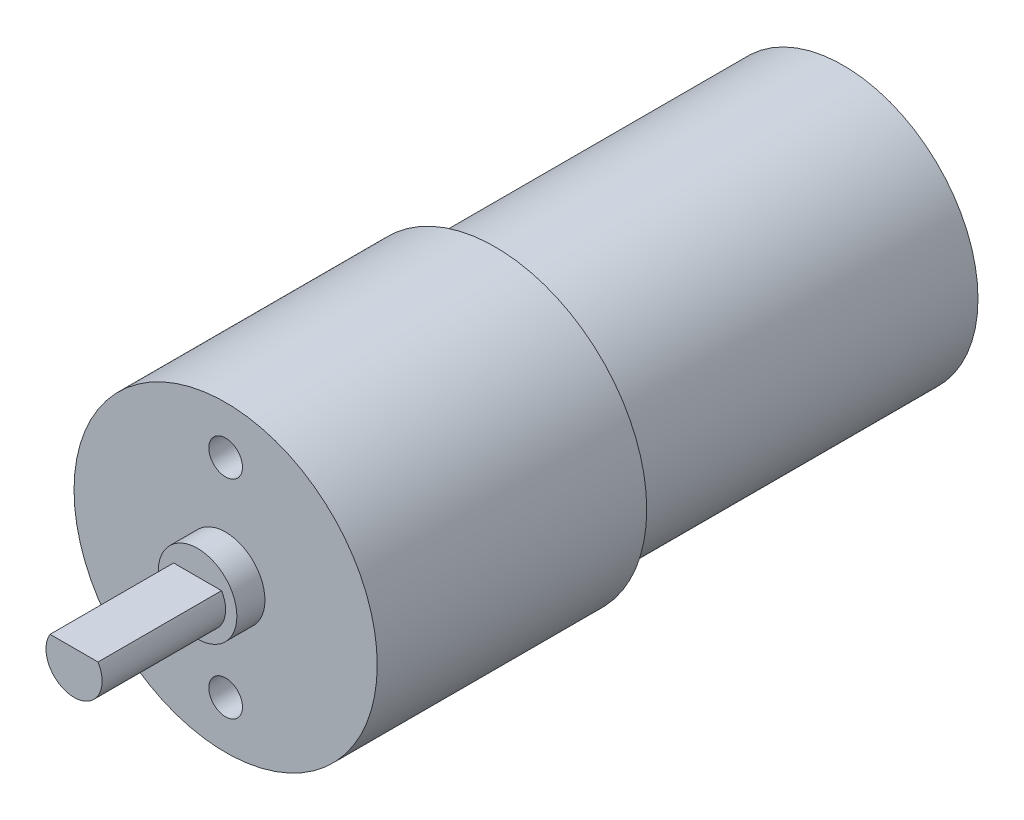
ISO-10303-21;
HEADER;
FILE_DESCRIPTION(('STEP AP214'),'2;1');
FILE_NAME('part.step','',(''),(''),'','','');
FILE_SCHEMA(('AUTOMOTIVE_DESIGN { 1 0 10303 214 1 1 1 1 }'));
ENDSEC;
DATA;
#1=APPLICATION_CONTEXT('core data for automotive mechanical design processes');
#2=APPLICATION_PROTOCOL_DEFINITION('international standard','automotive_design',2000,#1);
#3=PRODUCT_CONTEXT('',#1,'mechanical');
#4=PRODUCT('Part','Part','',(#3));
#5=PRODUCT_RELATED_PRODUCT_CATEGORY('part','',(#4));
#6=PRODUCT_DEFINITION_FORMATION('','',#4);
#7=PRODUCT_DEFINITION_CONTEXT('part definition',#1,'design');
#8=PRODUCT_DEFINITION('design','',#6,#7);
#9=PRODUCT_DEFINITION_SHAPE('','',#8);
#10=(LENGTH_UNIT() NAMED_UNIT(*) SI_UNIT(.MILLI.,.METRE.));
#11=(NAMED_UNIT(*) PLANE_ANGLE_UNIT() SI_UNIT($,.RADIAN.));
#12=(NAMED_UNIT(*) SI_UNIT($,.STERADIAN.) SOLID_ANGLE_UNIT());
#13=UNCERTAINTY_MEASURE_WITH_UNIT(LENGTH_MEASURE(1.E-05),#10,'distance_accuracy_value','');
#14=(GEOMETRIC_REPRESENTATION_CONTEXT(3) GLOBAL_UNCERTAINTY_ASSIGNED_CONTEXT((#13)) GLOBAL_UNIT_ASSIGNED_CONTEXT((#10,
#11,#12)) REPRESENTATION_CONTEXT('',''));
#15=CARTESIAN_POINT('',(0.,0.,0.));
#16=DIRECTION('',(0.,0.,1.));
#17=DIRECTION('',(1.,0.,0.));
#18=AXIS2_PLACEMENT_3D('',#15,#16,#17);
#19=CARTESIAN_POINT('',(0.,0.,-24.));
#20=DIRECTION('',(0.,0.,1.));
#21=DIRECTION('',(1.,0.,0.));
#22=AXIS2_PLACEMENT_3D('',#19,#20,#21);
#23=CYLINDRICAL_SURFACE('',#22,13.5);
#24=CARTESIAN_POINT('',(0.,0.,-24.));
#25=DIRECTION('',(0.,0.,1.));
#26=DIRECTION('',(1.,0.,0.));
#27=AXIS2_PLACEMENT_3D('',#24,#25,#26);
#28=CIRCLE('',#27,13.5);
#29=CARTESIAN_POINT('',(13.5,0.,-24.));
#30=VERTEX_POINT('',#29);
#31=EDGE_CURVE('E46',#30,#30,#28,.T.);
#32=ORIENTED_EDGE('',*,*,#31,.T.);
#33=EDGE_LOOP('',(#32));
#34=FACE_BOUND('',#33,.T.);
#35=CARTESIAN_POINT('',(0.,0.,0.));
#36=DIRECTION('',(0.,0.,1.));
#37=DIRECTION('',(1.,0.,0.));
#38=AXIS2_PLACEMENT_3D('',#35,#36,#37);
#39=CIRCLE('',#38,13.5);
#40=CARTESIAN_POINT('',(13.5,0.,0.));
#41=VERTEX_POINT('',#40);
#42=EDGE_CURVE('E41',#41,#41,#39,.T.);
#43=ORIENTED_EDGE('',*,*,#42,.F.);
#44=EDGE_LOOP('',(#43));
#45=FACE_BOUND('',#44,.T.);
#46=ADVANCED_FACE('F38',(#34,#45),#23,.T.);
#47=CARTESIAN_POINT('',(0.,0.,-24.));
#48=DIRECTION('',(0.,0.,1.));
#49=DIRECTION('',(1.,0.,0.));
#50=AXIS2_PLACEMENT_3D('',#47,#48,#49);
#51=PLANE('',#50);
#52=CARTESIAN_POINT('',(0.,0.,-24.));
#53=DIRECTION('',(0.,0.,1.));
#54=DIRECTION('',(1.,0.,0.));
#55=AXIS2_PLACEMENT_3D('',#52,#53,#54);
#56=CIRCLE('',#55,12.);
#57=CARTESIAN_POINT('',(12.,0.,-24.));
#58=VERTEX_POINT('',#57);
#59=EDGE_CURVE('E88',#58,#58,#56,.T.);
#60=ORIENTED_EDGE('',*,*,#59,.T.);
#61=EDGE_LOOP('',(#60));
#62=FACE_BOUND('',#61,.T.);
#63=ORIENTED_EDGE('',*,*,#31,.F.);
#64=EDGE_LOOP('',(#63));
#65=FACE_BOUND('',#64,.T.);
#66=ADVANCED_FACE('F103',(#62,#65),#51,.F.);
#67=CARTESIAN_POINT('',(0.,0.,0.));
#68=DIRECTION('',(0.,0.,1.));
#69=DIRECTION('',(1.,0.,0.));
#70=AXIS2_PLACEMENT_3D('',#67,#68,#69);
#71=PLANE('',#70);
#72=CARTESIAN_POINT('',(0.,9.25,0.));
#73=DIRECTION('',(0.,0.,1.));
#74=DIRECTION('',(1.,0.,0.));
#75=AXIS2_PLACEMENT_3D('',#72,#73,#74);
#76=CIRCLE('',#75,1.5);
#77=CARTESIAN_POINT('',(1.5,9.25,0.));
#78=VERTEX_POINT('',#77);
#79=EDGE_CURVE('E155',#78,#78,#76,.T.);
#80=ORIENTED_EDGE('',*,*,#79,.F.);
#81=EDGE_LOOP('',(#80));
#82=FACE_BOUND('',#81,.T.);
#83=CARTESIAN_POINT('',(0.,-9.25,0.));
#84=DIRECTION('',(0.,0.,1.));
#85=DIRECTION('',(1.,0.,0.));
#86=AXIS2_PLACEMENT_3D('',#83,#84,#85);
#87=CIRCLE('',#86,1.5);
#88=CARTESIAN_POINT('',(1.5,-9.25,0.));
#89=VERTEX_POINT('',#88);
#90=EDGE_CURVE('E158',#89,#89,#87,.T.);
#91=ORIENTED_EDGE('',*,*,#90,.F.);
#92=EDGE_LOOP('',(#91));
#93=FACE_BOUND('',#92,.T.);
#94=CARTESIAN_POINT('',(0.,0.,0.));
#95=DIRECTION('',(0.,0.,1.));
#96=DIRECTION('',(1.,0.,0.));
#97=AXIS2_PLACEMENT_3D('',#94,#95,#96);
#98=CIRCLE('',#97,3.5);
#99=CARTESIAN_POINT('',(3.5,0.,0.));
#100=VERTEX_POINT('',#99);
#101=EDGE_CURVE('E11',#100,#100,#98,.T.);
#102=ORIENTED_EDGE('',*,*,#101,.F.);
#103=EDGE_LOOP('',(#102));
#104=FACE_BOUND('',#103,.T.);
#105=ORIENTED_EDGE('',*,*,#42,.T.);
#106=EDGE_LOOP('',(#105));
#107=FACE_BOUND('',#106,.T.);
#108=ADVANCED_FACE('F100',(#82,#93,#104,#107),#71,.T.);
#109=CARTESIAN_POINT('',(0.,0.,-55.));
#110=DIRECTION('',(0.,0.,1.));
#111=DIRECTION('',(1.,0.,0.));
#112=AXIS2_PLACEMENT_3D('',#109,#110,#111);
#113=CYLINDRICAL_SURFACE('',#112,12.);
#114=CARTESIAN_POINT('',(0.,0.,-55.));
#115=DIRECTION('',(0.,0.,1.));
#116=DIRECTION('',(1.,0.,0.));
#117=AXIS2_PLACEMENT_3D('',#114,#115,#116);
#118=CIRCLE('',#117,12.);
#119=CARTESIAN_POINT('',(12.,0.,-55.));
#120=VERTEX_POINT('',#119);
#121=EDGE_CURVE('E90',#120,#120,#118,.T.);
#122=ORIENTED_EDGE('',*,*,#121,.T.);
#123=EDGE_LOOP('',(#122));
#124=FACE_BOUND('',#123,.T.);
#125=ORIENTED_EDGE('',*,*,#59,.F.);
#126=EDGE_LOOP('',(#125));
#127=FACE_BOUND('',#126,.T.);
#128=ADVANCED_FACE('F112',(#124,#127),#113,.T.);
#129=CARTESIAN_POINT('',(0.,0.,-55.));
#130=DIRECTION('',(0.,0.,1.));
#131=DIRECTION('',(1.,0.,0.));
#132=AXIS2_PLACEMENT_3D('',#129,#130,#131);
#133=PLANE('',#132);
#134=ORIENTED_EDGE('',*,*,#121,.F.);
#135=EDGE_LOOP('',(#134));
#136=FACE_BOUND('',#135,.T.);
#137=ADVANCED_FACE('F118',(#136),#133,.F.);
#138=CARTESIAN_POINT('',(0.,0.,2.5));
#139=DIRECTION('',(0.,0.,-1.));
#140=DIRECTION('',(-1.,0.,0.));
#141=AXIS2_PLACEMENT_3D('',#138,#139,#140);
#142=CYLINDRICAL_SURFACE('',#141,3.5);
#143=CARTESIAN_POINT('',(0.,0.,2.5));
#144=DIRECTION('',(0.,0.,1.));
#145=DIRECTION('',(1.,0.,0.));
#146=AXIS2_PLACEMENT_3D('',#143,#144,#145);
#147=CIRCLE('',#146,3.5);
#148=CARTESIAN_POINT('',(3.5,0.,2.5));
#149=VERTEX_POINT('',#148);
#150=EDGE_CURVE('E83',#149,#149,#147,.T.);
#151=ORIENTED_EDGE('',*,*,#150,.F.);
#152=EDGE_LOOP('',(#151));
#153=FACE_BOUND('',#152,.T.);
#154=ORIENTED_EDGE('',*,*,#101,.T.);
#155=EDGE_LOOP('',(#154));
#156=FACE_BOUND('',#155,.T.);
#157=ADVANCED_FACE('F122',(#153,#156),#142,.T.);
#158=CARTESIAN_POINT('',(0.,0.,2.5));
#159=DIRECTION('',(0.,0.,1.));
#160=DIRECTION('',(1.,0.,0.));
#161=AXIS2_PLACEMENT_3D('',#158,#159,#160);
#162=PLANE('',#161);
#163=CARTESIAN_POINT('',(0.,0.,2.5));
#164=DIRECTION('',(0.,0.,1.));
#165=DIRECTION('',(1.,0.,0.));
#166=AXIS2_PLACEMENT_3D('',#163,#164,#165);
#167=CIRCLE('',#166,2.5);
#168=CARTESIAN_POINT('',(-2.13541565040626,1.3,2.5));
#169=VERTEX_POINT('',#168);
#170=CARTESIAN_POINT('',(2.13541565040626,1.3,2.5));
#171=VERTEX_POINT('',#170);
#172=EDGE_CURVE('E66',#169,#171,#167,.T.);
#173=ORIENTED_EDGE('',*,*,#172,.F.);
#174=DIRECTION('',(-1.,0.,0.));
#175=VECTOR('',#174,1.);
#176=CARTESIAN_POINT('',(0.,1.3,2.5));
#177=LINE('',#176,#175);
#178=EDGE_CURVE('E53',#171,#169,#177,.T.);
#179=ORIENTED_EDGE('',*,*,#178,.F.);
#180=EDGE_LOOP('',(#173,#179));
#181=FACE_BOUND('',#180,.T.);
#182=ORIENTED_EDGE('',*,*,#150,.T.);
#183=EDGE_LOOP('',(#182));
#184=FACE_BOUND('',#183,.T.);
#185=ADVANCED_FACE('F67',(#181,#184),#162,.T.);
#186=CARTESIAN_POINT('',(0.,0.,13.5));
#187=DIRECTION('',(0.,0.,-1.));
#188=DIRECTION('',(-1.,0.,0.));
#189=AXIS2_PLACEMENT_3D('',#186,#187,#188);
#190=CYLINDRICAL_SURFACE('',#189,2.5);
#191=ORIENTED_EDGE('',*,*,#172,.T.);
#192=DIRECTION('',(0.,0.,-1.));
#193=VECTOR('',#192,1.);
#194=CARTESIAN_POINT('',(2.13541565040626,1.3,13.5));
#195=LINE('',#194,#193);
#196=CARTESIAN_POINT('',(2.13541565040626,1.3,13.5));
#197=VERTEX_POINT('',#196);
#198=EDGE_CURVE('E78',#197,#171,#195,.T.);
#199=ORIENTED_EDGE('',*,*,#198,.F.);
#200=CARTESIAN_POINT('',(0.,0.,13.5));
#201=DIRECTION('',(0.,0.,1.));
#202=DIRECTION('',(1.,0.,0.));
#203=AXIS2_PLACEMENT_3D('',#200,#201,#202);
#204=CIRCLE('',#203,2.5);
#205=CARTESIAN_POINT('',(-2.13541565040626,1.3,13.5));
#206=VERTEX_POINT('',#205);
#207=EDGE_CURVE('E79',#206,#197,#204,.T.);
#208=ORIENTED_EDGE('',*,*,#207,.F.);
#209=DIRECTION('',(0.,0.,-1.));
#210=VECTOR('',#209,1.);
#211=CARTESIAN_POINT('',(-2.13541565040626,1.3,13.5));
#212=LINE('',#211,#210);
#213=EDGE_CURVE('E76',#206,#169,#212,.T.);
#214=ORIENTED_EDGE('',*,*,#213,.T.);
#215=EDGE_LOOP('',(#191,#199,#208,#214));
#216=FACE_BOUND('',#215,.T.);
#217=ADVANCED_FACE('F81',(#216),#190,.T.);
#218=CARTESIAN_POINT('',(0.,1.3,13.5));
#219=DIRECTION('',(0.,-1.,0.));
#220=DIRECTION('',(0.,0.,-1.));
#221=AXIS2_PLACEMENT_3D('',#218,#219,#220);
#222=PLANE('',#221);
#223=ORIENTED_EDGE('',*,*,#178,.T.);
#224=ORIENTED_EDGE('',*,*,#213,.F.);
#225=DIRECTION('',(-1.,0.,0.));
#226=VECTOR('',#225,1.);
#227=CARTESIAN_POINT('',(0.,1.3,13.5));
#228=LINE('',#227,#226);
#229=EDGE_CURVE('E61',#197,#206,#228,.T.);
#230=ORIENTED_EDGE('',*,*,#229,.F.);
#231=ORIENTED_EDGE('',*,*,#198,.T.);
#232=EDGE_LOOP('',(#223,#224,#230,#231));
#233=FACE_BOUND('',#232,.T.);
#234=ADVANCED_FACE('F75',(#233),#222,.F.);
#235=CARTESIAN_POINT('',(0.,0.,13.5));
#236=DIRECTION('',(0.,0.,1.));
#237=DIRECTION('',(1.,0.,0.));
#238=AXIS2_PLACEMENT_3D('',#235,#236,#237);
#239=PLANE('',#238);
#240=ORIENTED_EDGE('',*,*,#207,.T.);
#241=ORIENTED_EDGE('',*,*,#229,.T.);
#242=EDGE_LOOP('',(#240,#241));
#243=FACE_BOUND('',#242,.T.);
#244=ADVANCED_FACE('F133',(#243),#239,.T.);
#245=CARTESIAN_POINT('',(0.,-9.25,-4.));
#246=DIRECTION('',(0.,0.,1.));
#247=DIRECTION('',(1.,0.,0.));
#248=AXIS2_PLACEMENT_3D('',#245,#246,#247);
#249=CYLINDRICAL_SURFACE('',#248,1.5);
#250=CARTESIAN_POINT('',(0.,-9.25,-4.));
#251=DIRECTION('',(0.,0.,1.));
#252=DIRECTION('',(1.,0.,0.));
#253=AXIS2_PLACEMENT_3D('',#250,#251,#252);
#254=CIRCLE('',#253,1.5);
#255=CARTESIAN_POINT('',(1.5,-9.25,-4.));
#256=VERTEX_POINT('',#255);
#257=EDGE_CURVE('E163',#256,#256,#254,.T.);
#258=ORIENTED_EDGE('',*,*,#257,.F.);
#259=EDGE_LOOP('',(#258));
#260=FACE_BOUND('',#259,.T.);
#261=ORIENTED_EDGE('',*,*,#90,.T.);
#262=EDGE_LOOP('',(#261));
#263=FACE_BOUND('',#262,.T.);
#264=ADVANCED_FACE('F136',(#260,#263),#249,.F.);
#265=CARTESIAN_POINT('',(0.,-9.25,-4.));
#266=DIRECTION('',(0.,0.,1.));
#267=DIRECTION('',(1.,0.,0.));
#268=AXIS2_PLACEMENT_3D('',#265,#266,#267);
#269=PLANE('',#268);
#270=ORIENTED_EDGE('',*,*,#257,.T.);
#271=EDGE_LOOP('',(#270));
#272=FACE_BOUND('',#271,.T.);
#273=ADVANCED_FACE('F137',(#272),#269,.T.);
#274=CARTESIAN_POINT('',(0.,9.25,-4.));
#275=DIRECTION('',(0.,0.,1.));
#276=DIRECTION('',(1.,0.,0.));
#277=AXIS2_PLACEMENT_3D('',#274,#275,#276);
#278=CYLINDRICAL_SURFACE('',#277,1.5);
#279=CARTESIAN_POINT('',(0.,9.25,-4.));
#280=DIRECTION('',(0.,0.,1.));
#281=DIRECTION('',(1.,0.,0.));
#282=AXIS2_PLACEMENT_3D('',#279,#280,#281);
#283=CIRCLE('',#282,1.5);
#284=CARTESIAN_POINT('',(1.5,9.25,-4.));
#285=VERTEX_POINT('',#284);
#286=EDGE_CURVE('E72',#285,#285,#283,.T.);
#287=ORIENTED_EDGE('',*,*,#286,.F.);
#288=EDGE_LOOP('',(#287));
#289=FACE_BOUND('',#288,.T.);
#290=ORIENTED_EDGE('',*,*,#79,.T.);
#291=EDGE_LOOP('',(#290));
#292=FACE_BOUND('',#291,.T.);
#293=ADVANCED_FACE('F140',(#289,#292),#278,.F.);
#294=CARTESIAN_POINT('',(0.,9.25,-4.));
#295=DIRECTION('',(0.,0.,1.));
#296=DIRECTION('',(1.,0.,0.));
#297=AXIS2_PLACEMENT_3D('',#294,#295,#296);
#298=PLANE('',#297);
#299=ORIENTED_EDGE('',*,*,#286,.T.);
#300=EDGE_LOOP('',(#299));
#301=FACE_BOUND('',#300,.T.);
#302=ADVANCED_FACE('F147',(#301),#298,.T.);
#303=CLOSED_SHELL('',(#46,#66,#108,#128,#137,#157,#185,#217,#234,#244,#264,#273,#293,#302));
#304=MANIFOLD_SOLID_BREP('B2',#303);
#305=ADVANCED_BREP_SHAPE_REPRESENTATION('',(#18,#304),#14);
#306=SHAPE_DEFINITION_REPRESENTATION(#9,#305);
ENDSEC;
END-ISO-10303-21;
